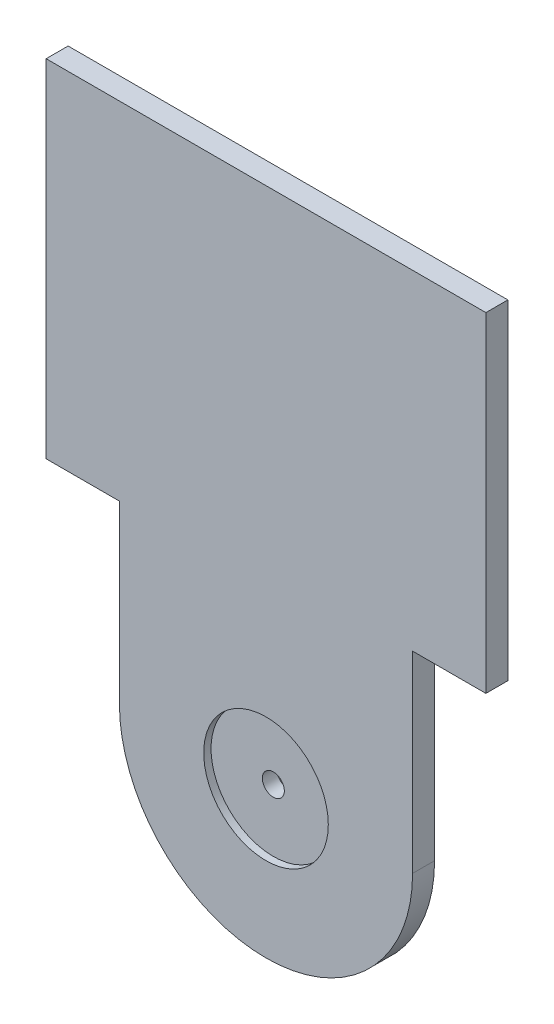
ISO-10303-21;
HEADER;
FILE_DESCRIPTION(('STEP AP214'),'2;1');
FILE_NAME('part.step','',(''),(''),'','','');
FILE_SCHEMA(('AUTOMOTIVE_DESIGN { 1 0 10303 214 1 1 1 1 }'));
ENDSEC;
DATA;
#1=APPLICATION_CONTEXT('core data for automotive mechanical design processes');
#2=APPLICATION_PROTOCOL_DEFINITION('international standard','automotive_design',2000,#1);
#3=PRODUCT_CONTEXT('',#1,'mechanical');
#4=PRODUCT('Part','Part','',(#3));
#5=PRODUCT_RELATED_PRODUCT_CATEGORY('part','',(#4));
#6=PRODUCT_DEFINITION_FORMATION('','',#4);
#7=PRODUCT_DEFINITION_CONTEXT('part definition',#1,'design');
#8=PRODUCT_DEFINITION('design','',#6,#7);
#9=PRODUCT_DEFINITION_SHAPE('','',#8);
#10=(LENGTH_UNIT() NAMED_UNIT(*) SI_UNIT(.MILLI.,.METRE.));
#11=(NAMED_UNIT(*) PLANE_ANGLE_UNIT() SI_UNIT($,.RADIAN.));
#12=(NAMED_UNIT(*) SI_UNIT($,.STERADIAN.) SOLID_ANGLE_UNIT());
#13=UNCERTAINTY_MEASURE_WITH_UNIT(LENGTH_MEASURE(1.E-05),#10,'distance_accuracy_value','');
#14=(GEOMETRIC_REPRESENTATION_CONTEXT(3) GLOBAL_UNCERTAINTY_ASSIGNED_CONTEXT((#13)) GLOBAL_UNIT_ASSIGNED_CONTEXT((#10,
#11,#12)) REPRESENTATION_CONTEXT('',''));
#15=CARTESIAN_POINT('',(0.,0.,0.));
#16=DIRECTION('',(0.,0.,1.));
#17=DIRECTION('',(1.,0.,0.));
#18=AXIS2_PLACEMENT_3D('',#15,#16,#17);
#19=CARTESIAN_POINT('',(-93.991811362998,10.9707882048787,3.));
#20=DIRECTION('',(0.,0.,-1.));
#21=DIRECTION('',(-1.,0.,0.));
#22=AXIS2_PLACEMENT_3D('',#19,#20,#21);
#23=CYLINDRICAL_SURFACE('',#22,1.5);
#24=CARTESIAN_POINT('',(-93.991811362998,10.9707882048787,0.));
#25=DIRECTION('',(0.,0.,1.));
#26=DIRECTION('',(1.,0.,0.));
#27=AXIS2_PLACEMENT_3D('',#24,#25,#26);
#28=CIRCLE('',#27,1.5);
#29=CARTESIAN_POINT('',(-92.491811362998,10.9707882048787,0.));
#30=VERTEX_POINT('',#29);
#31=EDGE_CURVE('E135',#30,#30,#28,.T.);
#32=ORIENTED_EDGE('',*,*,#31,.F.);
#33=EDGE_LOOP('',(#32));
#34=FACE_BOUND('',#33,.T.);
#35=CARTESIAN_POINT('',(-93.991811362998,10.9707882048787,2.));
#36=DIRECTION('',(0.,0.,1.));
#37=DIRECTION('',(1.,0.,0.));
#38=AXIS2_PLACEMENT_3D('',#35,#36,#37);
#39=CIRCLE('',#38,1.5);
#40=CARTESIAN_POINT('',(-92.491811362998,10.9707882048787,2.));
#41=VERTEX_POINT('',#40);
#42=EDGE_CURVE('E37',#41,#41,#39,.T.);
#43=ORIENTED_EDGE('',*,*,#42,.T.);
#44=EDGE_LOOP('',(#43));
#45=FACE_BOUND('',#44,.T.);
#46=ADVANCED_FACE('F33',(#34,#45),#23,.F.);
#47=CARTESIAN_POINT('',(-93.991811362998,10.9707882048787,3.));
#48=DIRECTION('',(0.,0.,1.));
#49=DIRECTION('',(1.,0.,0.));
#50=AXIS2_PLACEMENT_3D('',#47,#48,#49);
#51=PLANE('',#50);
#52=CARTESIAN_POINT('',(-93.991811362998,10.9707882048787,3.));
#53=DIRECTION('',(0.,0.,1.));
#54=DIRECTION('',(1.,0.,0.));
#55=AXIS2_PLACEMENT_3D('',#52,#53,#54);
#56=CIRCLE('',#55,8.50000000000001);
#57=CARTESIAN_POINT('',(-85.491811362998,10.9707882048787,3.));
#58=VERTEX_POINT('',#57);
#59=EDGE_CURVE('E183',#58,#58,#56,.T.);
#60=ORIENTED_EDGE('',*,*,#59,.F.);
#61=EDGE_LOOP('',(#60));
#62=FACE_BOUND('',#61,.T.);
#63=CARTESIAN_POINT('',(-93.991811362998,10.9707882048787,3.));
#64=DIRECTION('',(0.,0.,1.));
#65=DIRECTION('',(1.,0.,0.));
#66=AXIS2_PLACEMENT_3D('',#63,#64,#65);
#67=CIRCLE('',#66,20.);
#68=CARTESIAN_POINT('',(-113.991811362998,10.9707882048787,3.));
#69=VERTEX_POINT('',#68);
#70=CARTESIAN_POINT('',(-73.991811362998,10.9707882048787,3.));
#71=VERTEX_POINT('',#70);
#72=EDGE_CURVE('E146',#69,#71,#67,.T.);
#73=ORIENTED_EDGE('',*,*,#72,.T.);
#74=DIRECTION('',(0.,1.,0.));
#75=VECTOR('',#74,1.);
#76=CARTESIAN_POINT('',(-73.991811362998,10.9707882048787,3.));
#77=LINE('',#76,#75);
#78=CARTESIAN_POINT('',(-73.991811362998,37.236637471383,3.));
#79=VERTEX_POINT('',#78);
#80=EDGE_CURVE('E94',#71,#79,#77,.T.);
#81=ORIENTED_EDGE('',*,*,#80,.T.);
#82=DIRECTION('',(1.,0.,0.));
#83=VECTOR('',#82,1.);
#84=CARTESIAN_POINT('',(-73.991811362998,37.236637471383,3.));
#85=LINE('',#84,#83);
#86=CARTESIAN_POINT('',(-63.991811362998,37.236637471383,3.));
#87=VERTEX_POINT('',#86);
#88=EDGE_CURVE('E162',#79,#87,#85,.T.);
#89=ORIENTED_EDGE('',*,*,#88,.T.);
#90=DIRECTION('',(0.,1.,0.));
#91=VECTOR('',#90,1.);
#92=CARTESIAN_POINT('',(-63.991811362998,37.236637471383,3.));
#93=LINE('',#92,#91);
#94=CARTESIAN_POINT('',(-63.991811362998,82.236637471383,3.));
#95=VERTEX_POINT('',#94);
#96=EDGE_CURVE('E175',#87,#95,#93,.T.);
#97=ORIENTED_EDGE('',*,*,#96,.T.);
#98=DIRECTION('',(-1.,0.,0.));
#99=VECTOR('',#98,1.);
#100=CARTESIAN_POINT('',(-123.991811362998,82.2366374713831,3.));
#101=LINE('',#100,#99);
#102=CARTESIAN_POINT('',(-123.991811362998,82.2366374713831,3.));
#103=VERTEX_POINT('',#102);
#104=EDGE_CURVE('E113',#95,#103,#101,.T.);
#105=ORIENTED_EDGE('',*,*,#104,.T.);
#106=DIRECTION('',(0.,-1.,0.));
#107=VECTOR('',#106,1.);
#108=CARTESIAN_POINT('',(-123.991811362998,34.9581087916753,3.));
#109=LINE('',#108,#107);
#110=CARTESIAN_POINT('',(-123.991811362998,34.9581087916753,3.));
#111=VERTEX_POINT('',#110);
#112=EDGE_CURVE('E107',#103,#111,#109,.T.);
#113=ORIENTED_EDGE('',*,*,#112,.T.);
#114=DIRECTION('',(1.,0.,0.));
#115=VECTOR('',#114,1.);
#116=CARTESIAN_POINT('',(-113.991811362998,34.9581087916753,3.));
#117=LINE('',#116,#115);
#118=CARTESIAN_POINT('',(-113.991811362998,34.9581087916753,3.));
#119=VERTEX_POINT('',#118);
#120=EDGE_CURVE('E111',#111,#119,#117,.T.);
#121=ORIENTED_EDGE('',*,*,#120,.T.);
#122=DIRECTION('',(0.,-1.,0.));
#123=VECTOR('',#122,1.);
#124=CARTESIAN_POINT('',(-113.991811362998,10.9707882048787,3.));
#125=LINE('',#124,#123);
#126=EDGE_CURVE('E51',#119,#69,#125,.T.);
#127=ORIENTED_EDGE('',*,*,#126,.T.);
#128=EDGE_LOOP('',(#73,#81,#89,#97,#105,#113,#121,#127));
#129=FACE_BOUND('',#128,.T.);
#130=ADVANCED_FACE('F109',(#62,#129),#51,.T.);
#131=CARTESIAN_POINT('',(-93.991811362998,10.9707882048787,0.));
#132=DIRECTION('',(0.,0.,1.));
#133=DIRECTION('',(1.,0.,0.));
#134=AXIS2_PLACEMENT_3D('',#131,#132,#133);
#135=PLANE('',#134);
#136=CARTESIAN_POINT('',(-93.991811362998,10.9707882048787,0.));
#137=DIRECTION('',(0.,0.,1.));
#138=DIRECTION('',(1.,0.,0.));
#139=AXIS2_PLACEMENT_3D('',#136,#137,#138);
#140=CIRCLE('',#139,20.);
#141=CARTESIAN_POINT('',(-113.991811362998,10.9707882048787,0.));
#142=VERTEX_POINT('',#141);
#143=CARTESIAN_POINT('',(-73.991811362998,10.9707882048787,0.));
#144=VERTEX_POINT('',#143);
#145=EDGE_CURVE('E131',#142,#144,#140,.T.);
#146=ORIENTED_EDGE('',*,*,#145,.F.);
#147=DIRECTION('',(0.,-1.,0.));
#148=VECTOR('',#147,1.);
#149=CARTESIAN_POINT('',(-113.991811362998,10.9707882048787,0.));
#150=LINE('',#149,#148);
#151=CARTESIAN_POINT('',(-113.991811362998,34.9581087916753,0.));
#152=VERTEX_POINT('',#151);
#153=EDGE_CURVE('E86',#152,#142,#150,.T.);
#154=ORIENTED_EDGE('',*,*,#153,.F.);
#155=DIRECTION('',(1.,0.,0.));
#156=VECTOR('',#155,1.);
#157=CARTESIAN_POINT('',(-113.991811362998,34.9581087916753,0.));
#158=LINE('',#157,#156);
#159=CARTESIAN_POINT('',(-123.991811362998,34.9581087916753,0.));
#160=VERTEX_POINT('',#159);
#161=EDGE_CURVE('E80',#160,#152,#158,.T.);
#162=ORIENTED_EDGE('',*,*,#161,.F.);
#163=DIRECTION('',(0.,-1.,0.));
#164=VECTOR('',#163,1.);
#165=CARTESIAN_POINT('',(-123.991811362998,34.9581087916753,0.));
#166=LINE('',#165,#164);
#167=CARTESIAN_POINT('',(-123.991811362998,82.2366374713831,0.));
#168=VERTEX_POINT('',#167);
#169=EDGE_CURVE('E121',#168,#160,#166,.T.);
#170=ORIENTED_EDGE('',*,*,#169,.F.);
#171=DIRECTION('',(-1.,0.,0.));
#172=VECTOR('',#171,1.);
#173=CARTESIAN_POINT('',(-123.991811362998,82.2366374713831,0.));
#174=LINE('',#173,#172);
#175=CARTESIAN_POINT('',(-63.991811362998,82.236637471383,0.));
#176=VERTEX_POINT('',#175);
#177=EDGE_CURVE('E141',#176,#168,#174,.T.);
#178=ORIENTED_EDGE('',*,*,#177,.F.);
#179=DIRECTION('',(0.,1.,0.));
#180=VECTOR('',#179,1.);
#181=CARTESIAN_POINT('',(-63.991811362998,37.236637471383,0.));
#182=LINE('',#181,#180);
#183=CARTESIAN_POINT('',(-63.991811362998,37.236637471383,0.));
#184=VERTEX_POINT('',#183);
#185=EDGE_CURVE('E139',#184,#176,#182,.T.);
#186=ORIENTED_EDGE('',*,*,#185,.F.);
#187=DIRECTION('',(1.,0.,0.));
#188=VECTOR('',#187,1.);
#189=CARTESIAN_POINT('',(-73.991811362998,37.236637471383,0.));
#190=LINE('',#189,#188);
#191=CARTESIAN_POINT('',(-73.991811362998,37.236637471383,0.));
#192=VERTEX_POINT('',#191);
#193=EDGE_CURVE('E137',#192,#184,#190,.T.);
#194=ORIENTED_EDGE('',*,*,#193,.F.);
#195=DIRECTION('',(0.,1.,0.));
#196=VECTOR('',#195,1.);
#197=CARTESIAN_POINT('',(-73.991811362998,10.9707882048787,0.));
#198=LINE('',#197,#196);
#199=EDGE_CURVE('E134',#144,#192,#198,.T.);
#200=ORIENTED_EDGE('',*,*,#199,.F.);
#201=EDGE_LOOP('',(#146,#154,#162,#170,#178,#186,#194,#200));
#202=FACE_BOUND('',#201,.T.);
#203=ORIENTED_EDGE('',*,*,#31,.T.);
#204=EDGE_LOOP('',(#203));
#205=FACE_BOUND('',#204,.T.);
#206=ADVANCED_FACE('F166',(#202,#205),#135,.F.);
#207=CARTESIAN_POINT('',(-93.991811362998,10.9707882048787,3.));
#208=DIRECTION('',(0.,0.,-1.));
#209=DIRECTION('',(-1.,0.,0.));
#210=AXIS2_PLACEMENT_3D('',#207,#208,#209);
#211=CYLINDRICAL_SURFACE('',#210,20.);
#212=ORIENTED_EDGE('',*,*,#145,.T.);
#213=DIRECTION('',(0.,0.,-1.));
#214=VECTOR('',#213,1.);
#215=CARTESIAN_POINT('',(-73.991811362998,10.9707882048787,3.));
#216=LINE('',#215,#214);
#217=EDGE_CURVE('E11',#71,#144,#216,.T.);
#218=ORIENTED_EDGE('',*,*,#217,.F.);
#219=ORIENTED_EDGE('',*,*,#72,.F.);
#220=DIRECTION('',(0.,0.,-1.));
#221=VECTOR('',#220,1.);
#222=CARTESIAN_POINT('',(-113.991811362998,10.9707882048787,3.));
#223=LINE('',#222,#221);
#224=EDGE_CURVE('E127',#69,#142,#223,.T.);
#225=ORIENTED_EDGE('',*,*,#224,.T.);
#226=EDGE_LOOP('',(#212,#218,#219,#225));
#227=FACE_BOUND('',#226,.T.);
#228=ADVANCED_FACE('F35',(#227),#211,.T.);
#229=CARTESIAN_POINT('',(-73.991811362998,10.9707882048787,3.));
#230=DIRECTION('',(-1.,0.,0.));
#231=DIRECTION('',(0.,0.,1.));
#232=AXIS2_PLACEMENT_3D('',#229,#230,#231);
#233=PLANE('',#232);
#234=ORIENTED_EDGE('',*,*,#199,.T.);
#235=DIRECTION('',(0.,0.,-1.));
#236=VECTOR('',#235,1.);
#237=CARTESIAN_POINT('',(-73.991811362998,37.236637471383,3.));
#238=LINE('',#237,#236);
#239=EDGE_CURVE('E43',#79,#192,#238,.T.);
#240=ORIENTED_EDGE('',*,*,#239,.F.);
#241=ORIENTED_EDGE('',*,*,#80,.F.);
#242=ORIENTED_EDGE('',*,*,#217,.T.);
#243=EDGE_LOOP('',(#234,#240,#241,#242));
#244=FACE_BOUND('',#243,.T.);
#245=ADVANCED_FACE('F227',(#244),#233,.F.);
#246=CARTESIAN_POINT('',(-73.991811362998,37.236637471383,3.));
#247=DIRECTION('',(0.,1.,0.));
#248=DIRECTION('',(-1.,0.,0.));
#249=AXIS2_PLACEMENT_3D('',#246,#247,#248);
#250=PLANE('',#249);
#251=ORIENTED_EDGE('',*,*,#193,.T.);
#252=DIRECTION('',(0.,0.,-1.));
#253=VECTOR('',#252,1.);
#254=CARTESIAN_POINT('',(-63.991811362998,37.236637471383,3.));
#255=LINE('',#254,#253);
#256=EDGE_CURVE('E153',#87,#184,#255,.T.);
#257=ORIENTED_EDGE('',*,*,#256,.F.);
#258=ORIENTED_EDGE('',*,*,#88,.F.);
#259=ORIENTED_EDGE('',*,*,#239,.T.);
#260=EDGE_LOOP('',(#251,#257,#258,#259));
#261=FACE_BOUND('',#260,.T.);
#262=ADVANCED_FACE('F160',(#261),#250,.F.);
#263=CARTESIAN_POINT('',(-63.991811362998,37.236637471383,3.));
#264=DIRECTION('',(-1.,0.,0.));
#265=DIRECTION('',(0.,0.,1.));
#266=AXIS2_PLACEMENT_3D('',#263,#264,#265);
#267=PLANE('',#266);
#268=ORIENTED_EDGE('',*,*,#185,.T.);
#269=DIRECTION('',(0.,0.,-1.));
#270=VECTOR('',#269,1.);
#271=CARTESIAN_POINT('',(-63.991811362998,82.236637471383,3.));
#272=LINE('',#271,#270);
#273=EDGE_CURVE('E150',#95,#176,#272,.T.);
#274=ORIENTED_EDGE('',*,*,#273,.F.);
#275=ORIENTED_EDGE('',*,*,#96,.F.);
#276=ORIENTED_EDGE('',*,*,#256,.T.);
#277=EDGE_LOOP('',(#268,#274,#275,#276));
#278=FACE_BOUND('',#277,.T.);
#279=ADVANCED_FACE('F171',(#278),#267,.F.);
#280=CARTESIAN_POINT('',(-123.991811362998,82.2366374713831,3.));
#281=DIRECTION('',(0.,-1.,0.));
#282=DIRECTION('',(1.,0.,0.));
#283=AXIS2_PLACEMENT_3D('',#280,#281,#282);
#284=PLANE('',#283);
#285=ORIENTED_EDGE('',*,*,#177,.T.);
#286=DIRECTION('',(0.,0.,-1.));
#287=VECTOR('',#286,1.);
#288=CARTESIAN_POINT('',(-123.991811362998,82.2366374713831,3.));
#289=LINE('',#288,#287);
#290=EDGE_CURVE('E122',#103,#168,#289,.T.);
#291=ORIENTED_EDGE('',*,*,#290,.F.);
#292=ORIENTED_EDGE('',*,*,#104,.F.);
#293=ORIENTED_EDGE('',*,*,#273,.T.);
#294=EDGE_LOOP('',(#285,#291,#292,#293));
#295=FACE_BOUND('',#294,.T.);
#296=ADVANCED_FACE('F174',(#295),#284,.F.);
#297=CARTESIAN_POINT('',(-123.991811362998,34.9581087916753,3.));
#298=DIRECTION('',(1.,0.,0.));
#299=DIRECTION('',(0.,0.,-1.));
#300=AXIS2_PLACEMENT_3D('',#297,#298,#299);
#301=PLANE('',#300);
#302=ORIENTED_EDGE('',*,*,#169,.T.);
#303=DIRECTION('',(0.,0.,-1.));
#304=VECTOR('',#303,1.);
#305=CARTESIAN_POINT('',(-123.991811362998,34.9581087916753,3.));
#306=LINE('',#305,#304);
#307=EDGE_CURVE('E118',#111,#160,#306,.T.);
#308=ORIENTED_EDGE('',*,*,#307,.F.);
#309=ORIENTED_EDGE('',*,*,#112,.F.);
#310=ORIENTED_EDGE('',*,*,#290,.T.);
#311=EDGE_LOOP('',(#302,#308,#309,#310));
#312=FACE_BOUND('',#311,.T.);
#313=ADVANCED_FACE('F119',(#312),#301,.F.);
#314=CARTESIAN_POINT('',(-113.991811362998,34.9581087916753,3.));
#315=DIRECTION('',(0.,1.,0.));
#316=DIRECTION('',(0.,0.,1.));
#317=AXIS2_PLACEMENT_3D('',#314,#315,#316);
#318=PLANE('',#317);
#319=ORIENTED_EDGE('',*,*,#161,.T.);
#320=DIRECTION('',(0.,0.,-1.));
#321=VECTOR('',#320,1.);
#322=CARTESIAN_POINT('',(-113.991811362998,34.9581087916753,3.));
#323=LINE('',#322,#321);
#324=EDGE_CURVE('E123',#119,#152,#323,.T.);
#325=ORIENTED_EDGE('',*,*,#324,.F.);
#326=ORIENTED_EDGE('',*,*,#120,.F.);
#327=ORIENTED_EDGE('',*,*,#307,.T.);
#328=EDGE_LOOP('',(#319,#325,#326,#327));
#329=FACE_BOUND('',#328,.T.);
#330=ADVANCED_FACE('F125',(#329),#318,.F.);
#331=CARTESIAN_POINT('',(-113.991811362998,10.9707882048787,3.));
#332=DIRECTION('',(1.,0.,0.));
#333=DIRECTION('',(0.,0.,-1.));
#334=AXIS2_PLACEMENT_3D('',#331,#332,#333);
#335=PLANE('',#334);
#336=ORIENTED_EDGE('',*,*,#153,.T.);
#337=ORIENTED_EDGE('',*,*,#224,.F.);
#338=ORIENTED_EDGE('',*,*,#126,.F.);
#339=ORIENTED_EDGE('',*,*,#324,.T.);
#340=EDGE_LOOP('',(#336,#337,#338,#339));
#341=FACE_BOUND('',#340,.T.);
#342=ADVANCED_FACE('F201',(#341),#335,.F.);
#343=CARTESIAN_POINT('',(-93.991811362998,10.9707882048787,2.));
#344=DIRECTION('',(0.,0.,1.));
#345=DIRECTION('',(1.,0.,0.));
#346=AXIS2_PLACEMENT_3D('',#343,#344,#345);
#347=CYLINDRICAL_SURFACE('',#346,8.50000000000001);
#348=CARTESIAN_POINT('',(-93.991811362998,10.9707882048787,2.));
#349=DIRECTION('',(0.,0.,1.));
#350=DIRECTION('',(1.,0.,0.));
#351=AXIS2_PLACEMENT_3D('',#348,#349,#350);
#352=CIRCLE('',#351,8.50000000000001);
#353=CARTESIAN_POINT('',(-85.491811362998,10.9707882048787,2.));
#354=VERTEX_POINT('',#353);
#355=EDGE_CURVE('E186',#354,#354,#352,.T.);
#356=ORIENTED_EDGE('',*,*,#355,.F.);
#357=EDGE_LOOP('',(#356));
#358=FACE_BOUND('',#357,.T.);
#359=ORIENTED_EDGE('',*,*,#59,.T.);
#360=EDGE_LOOP('',(#359));
#361=FACE_BOUND('',#360,.T.);
#362=ADVANCED_FACE('F196',(#358,#361),#347,.F.);
#363=CARTESIAN_POINT('',(-93.991811362998,10.9707882048787,2.));
#364=DIRECTION('',(0.,0.,1.));
#365=DIRECTION('',(1.,0.,0.));
#366=AXIS2_PLACEMENT_3D('',#363,#364,#365);
#367=PLANE('',#366);
#368=ORIENTED_EDGE('',*,*,#42,.F.);
#369=EDGE_LOOP('',(#368));
#370=FACE_BOUND('',#369,.T.);
#371=ORIENTED_EDGE('',*,*,#355,.T.);
#372=EDGE_LOOP('',(#371));
#373=FACE_BOUND('',#372,.T.);
#374=ADVANCED_FACE('F194',(#370,#373),#367,.T.);
#375=CLOSED_SHELL('',(#46,#130,#206,#228,#245,#262,#279,#296,#313,#330,#342,#362,#374));
#376=MANIFOLD_SOLID_BREP('B2',#375);
#377=ADVANCED_BREP_SHAPE_REPRESENTATION('',(#18,#376),#14);
#378=SHAPE_DEFINITION_REPRESENTATION(#9,#377);
ENDSEC;
END-ISO-10303-21;
